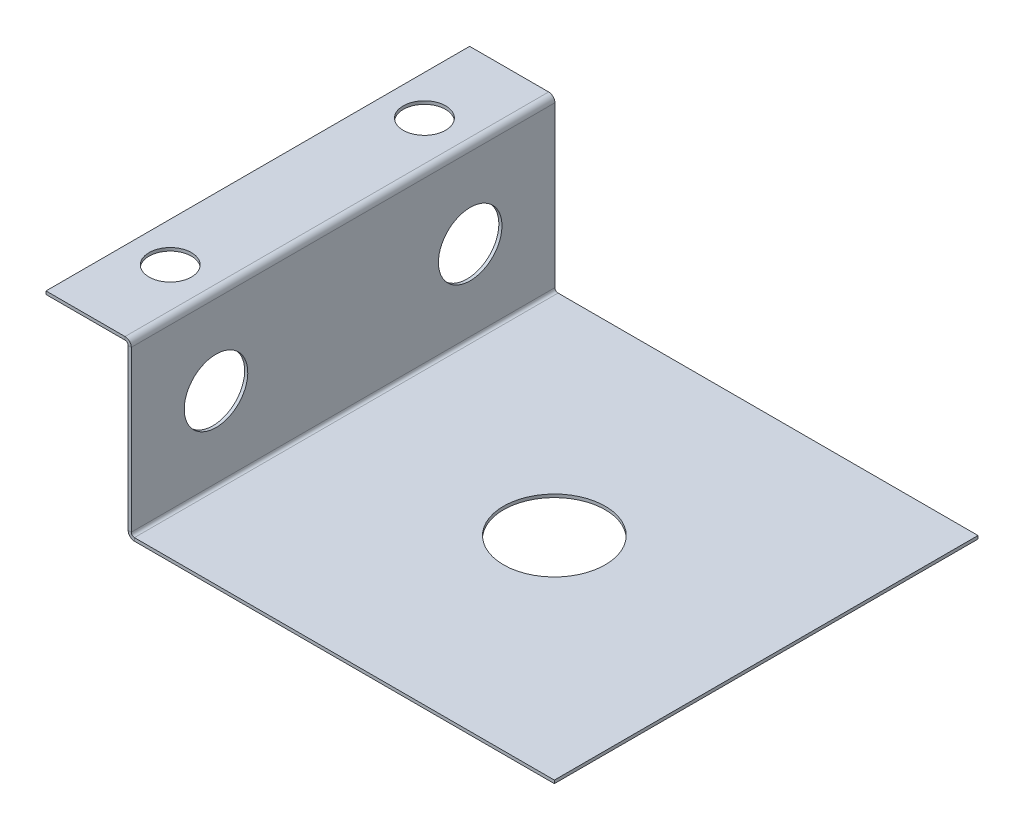
ISO-10303-21;
HEADER;
FILE_DESCRIPTION(('STEP AP214'),'2;1');
FILE_NAME('part.step','',(''),(''),'','','');
FILE_SCHEMA(('AUTOMOTIVE_DESIGN { 1 0 10303 214 1 1 1 1 }'));
ENDSEC;
DATA;
#1=APPLICATION_CONTEXT('core data for automotive mechanical design processes');
#2=APPLICATION_PROTOCOL_DEFINITION('international standard','automotive_design',2000,#1);
#3=PRODUCT_CONTEXT('',#1,'mechanical');
#4=PRODUCT('Part','Part','',(#3));
#5=PRODUCT_RELATED_PRODUCT_CATEGORY('part','',(#4));
#6=PRODUCT_DEFINITION_FORMATION('','',#4);
#7=PRODUCT_DEFINITION_CONTEXT('part definition',#1,'design');
#8=PRODUCT_DEFINITION('design','',#6,#7);
#9=PRODUCT_DEFINITION_SHAPE('','',#8);
#10=(LENGTH_UNIT() NAMED_UNIT(*) SI_UNIT(.MILLI.,.METRE.));
#11=(NAMED_UNIT(*) PLANE_ANGLE_UNIT() SI_UNIT($,.RADIAN.));
#12=(NAMED_UNIT(*) SI_UNIT($,.STERADIAN.) SOLID_ANGLE_UNIT());
#13=UNCERTAINTY_MEASURE_WITH_UNIT(LENGTH_MEASURE(1.E-05),#10,'distance_accuracy_value','');
#14=(GEOMETRIC_REPRESENTATION_CONTEXT(3) GLOBAL_UNCERTAINTY_ASSIGNED_CONTEXT((#13)) GLOBAL_UNIT_ASSIGNED_CONTEXT((#10,
#11,#12)) REPRESENTATION_CONTEXT('',''));
#15=CARTESIAN_POINT('',(0.,0.,0.));
#16=DIRECTION('',(0.,0.,1.));
#17=DIRECTION('',(1.,0.,0.));
#18=AXIS2_PLACEMENT_3D('',#15,#16,#17);
#19=CARTESIAN_POINT('',(-40.6054135692623,-40.1311864307378,0.));
#20=DIRECTION('',(1.,0.,0.));
#21=DIRECTION('',(0.,0.,1.));
#22=AXIS2_PLACEMENT_3D('',#19,#20,#21);
#23=PLANE('',#22);
#24=CARTESIAN_POINT('',(-40.6054135692621,19.6317,-30.));
#25=DIRECTION('',(1.,0.,0.));
#26=DIRECTION('',(0.,1.,0.));
#27=AXIS2_PLACEMENT_3D('',#24,#25,#26);
#28=CIRCLE('',#27,7.5);
#29=CARTESIAN_POINT('',(-40.6054135692621,27.1317,-30.));
#30=VERTEX_POINT('',#29);
#31=EDGE_CURVE('E299',#30,#30,#28,.T.);
#32=ORIENTED_EDGE('',*,*,#31,.T.);
#33=EDGE_LOOP('',(#32));
#34=FACE_BOUND('',#33,.T.);
#35=CARTESIAN_POINT('',(-40.6054135692621,19.6317,30.));
#36=DIRECTION('',(1.,0.,0.));
#37=DIRECTION('',(0.,1.,0.));
#38=AXIS2_PLACEMENT_3D('',#35,#36,#37);
#39=CIRCLE('',#38,7.5);
#40=CARTESIAN_POINT('',(-40.6054135692621,27.1317,30.));
#41=VERTEX_POINT('',#40);
#42=EDGE_CURVE('E287',#41,#41,#39,.T.);
#43=ORIENTED_EDGE('',*,*,#42,.T.);
#44=EDGE_LOOP('',(#43));
#45=FACE_BOUND('',#44,.T.);
#46=DIRECTION('',(0.,-1.,0.));
#47=VECTOR('',#46,1.);
#48=CARTESIAN_POINT('',(-40.6054135692625,-100.131186430738,50.));
#49=LINE('',#48,#47);
#50=CARTESIAN_POINT('',(-40.605413569262,38.5268,50.));
#51=VERTEX_POINT('',#50);
#52=CARTESIAN_POINT('',(-40.6054135692622,0.736600000000004,50.));
#53=VERTEX_POINT('',#52);
#54=EDGE_CURVE('E278',#51,#53,#49,.T.);
#55=ORIENTED_EDGE('',*,*,#54,.F.);
#56=DIRECTION('',(0.,0.,-1.));
#57=VECTOR('',#56,1.);
#58=CARTESIAN_POINT('',(-40.605413569262,38.5268,0.));
#59=LINE('',#58,#57);
#60=CARTESIAN_POINT('',(-40.605413569262,38.5268,-50.));
#61=VERTEX_POINT('',#60);
#62=EDGE_CURVE('E265',#51,#61,#59,.T.);
#63=ORIENTED_EDGE('',*,*,#62,.T.);
#64=DIRECTION('',(0.,1.,0.));
#65=VECTOR('',#64,1.);
#66=CARTESIAN_POINT('',(-40.6054135692625,-100.131186430738,-50.));
#67=LINE('',#66,#65);
#68=CARTESIAN_POINT('',(-40.6054135692622,0.736600000000008,-50.));
#69=VERTEX_POINT('',#68);
#70=EDGE_CURVE('E213',#69,#61,#67,.T.);
#71=ORIENTED_EDGE('',*,*,#70,.F.);
#72=DIRECTION('',(0.,0.,-1.));
#73=VECTOR('',#72,1.);
#74=CARTESIAN_POINT('',(-40.6054135692622,0.736600000000004,0.));
#75=LINE('',#74,#73);
#76=EDGE_CURVE('E252',#53,#69,#75,.T.);
#77=ORIENTED_EDGE('',*,*,#76,.F.);
#78=EDGE_LOOP('',(#55,#63,#71,#77));
#79=FACE_BOUND('',#78,.T.);
#80=ADVANCED_FACE('F46',(#34,#45,#79),#23,.F.);
#81=CARTESIAN_POINT('',(-40.6054135692625,-100.131186430738,-50.));
#82=DIRECTION('',(0.,0.,-1.));
#83=DIRECTION('',(0.,1.,0.));
#84=AXIS2_PLACEMENT_3D('',#81,#82,#83);
#85=PLANE('',#84);
#86=DIRECTION('',(-1.,0.,0.));
#87=VECTOR('',#86,1.);
#88=CARTESIAN_POINT('',(-40.605413569262,38.5268,-50.));
#89=LINE('',#88,#87);
#90=CARTESIAN_POINT('',(-39.868813569262,38.5268,-50.));
#91=VERTEX_POINT('',#90);
#92=EDGE_CURVE('E12',#91,#61,#89,.T.);
#93=ORIENTED_EDGE('',*,*,#92,.F.);
#94=DIRECTION('',(0.,1.,0.));
#95=VECTOR('',#94,1.);
#96=CARTESIAN_POINT('',(-39.8688135692625,-100.131186430738,-50.));
#97=LINE('',#96,#95);
#98=CARTESIAN_POINT('',(-39.8688135692622,0.736600000000004,-50.));
#99=VERTEX_POINT('',#98);
#100=EDGE_CURVE('E64',#99,#91,#97,.T.);
#101=ORIENTED_EDGE('',*,*,#100,.F.);
#102=DIRECTION('',(-1.,0.,0.));
#103=VECTOR('',#102,1.);
#104=CARTESIAN_POINT('',(-40.6054135692622,0.736600000000004,-50.));
#105=LINE('',#104,#103);
#106=EDGE_CURVE('E256',#99,#69,#105,.T.);
#107=ORIENTED_EDGE('',*,*,#106,.T.);
#108=ORIENTED_EDGE('',*,*,#70,.T.);
#109=EDGE_LOOP('',(#93,#101,#107,#108));
#110=FACE_BOUND('',#109,.T.);
#111=ADVANCED_FACE('F48',(#110),#85,.T.);
#112=CARTESIAN_POINT('',(-40.6054135692625,-100.131186430738,50.));
#113=DIRECTION('',(0.,0.,1.));
#114=DIRECTION('',(0.,-1.,0.));
#115=AXIS2_PLACEMENT_3D('',#112,#113,#114);
#116=PLANE('',#115);
#117=DIRECTION('',(1.,0.,0.));
#118=VECTOR('',#117,1.);
#119=CARTESIAN_POINT('',(-40.605413569262,38.5268,50.));
#120=LINE('',#119,#118);
#121=CARTESIAN_POINT('',(-39.868813569262,38.5268,50.));
#122=VERTEX_POINT('',#121);
#123=EDGE_CURVE('E269',#51,#122,#120,.T.);
#124=ORIENTED_EDGE('',*,*,#123,.F.);
#125=ORIENTED_EDGE('',*,*,#54,.T.);
#126=DIRECTION('',(1.,0.,0.));
#127=VECTOR('',#126,1.);
#128=CARTESIAN_POINT('',(-40.6054135692622,0.736600000000018,50.));
#129=LINE('',#128,#127);
#130=CARTESIAN_POINT('',(-39.8688135692622,0.736600000000018,50.));
#131=VERTEX_POINT('',#130);
#132=EDGE_CURVE('E262',#53,#131,#129,.T.);
#133=ORIENTED_EDGE('',*,*,#132,.T.);
#134=DIRECTION('',(0.,-1.,0.));
#135=VECTOR('',#134,1.);
#136=CARTESIAN_POINT('',(-39.8688135692625,-100.131186430738,50.));
#137=LINE('',#136,#135);
#138=EDGE_CURVE('E72',#122,#131,#137,.T.);
#139=ORIENTED_EDGE('',*,*,#138,.F.);
#140=EDGE_LOOP('',(#124,#125,#133,#139));
#141=FACE_BOUND('',#140,.T.);
#142=ADVANCED_FACE('F397',(#141),#116,.T.);
#143=CARTESIAN_POINT('',(-39.8688135692623,-40.1311864307378,0.));
#144=DIRECTION('',(1.,0.,0.));
#145=DIRECTION('',(0.,0.,1.));
#146=AXIS2_PLACEMENT_3D('',#143,#144,#145);
#147=PLANE('',#146);
#148=CARTESIAN_POINT('',(-39.8688135692621,19.6317,-30.));
#149=DIRECTION('',(1.,0.,0.));
#150=DIRECTION('',(0.,1.,0.));
#151=AXIS2_PLACEMENT_3D('',#148,#149,#150);
#152=CIRCLE('',#151,7.5);
#153=CARTESIAN_POINT('',(-39.8688135692621,27.1317,-30.));
#154=VERTEX_POINT('',#153);
#155=EDGE_CURVE('E50',#154,#154,#152,.T.);
#156=ORIENTED_EDGE('',*,*,#155,.F.);
#157=EDGE_LOOP('',(#156));
#158=FACE_BOUND('',#157,.T.);
#159=CARTESIAN_POINT('',(-39.8688135692621,19.6317,30.));
#160=DIRECTION('',(1.,0.,0.));
#161=DIRECTION('',(0.,1.,0.));
#162=AXIS2_PLACEMENT_3D('',#159,#160,#161);
#163=CIRCLE('',#162,7.5);
#164=CARTESIAN_POINT('',(-39.8688135692621,27.1317,30.));
#165=VERTEX_POINT('',#164);
#166=EDGE_CURVE('E284',#165,#165,#163,.T.);
#167=ORIENTED_EDGE('',*,*,#166,.F.);
#168=EDGE_LOOP('',(#167));
#169=FACE_BOUND('',#168,.T.);
#170=DIRECTION('',(0.,0.,-1.));
#171=VECTOR('',#170,1.);
#172=CARTESIAN_POINT('',(-39.868813569262,38.5268,0.));
#173=LINE('',#172,#171);
#174=EDGE_CURVE('E56',#122,#91,#173,.T.);
#175=ORIENTED_EDGE('',*,*,#174,.F.);
#176=ORIENTED_EDGE('',*,*,#138,.T.);
#177=DIRECTION('',(0.,0.,-1.));
#178=VECTOR('',#177,1.);
#179=CARTESIAN_POINT('',(-39.8688135692622,0.736600000000004,0.));
#180=LINE('',#179,#178);
#181=EDGE_CURVE('E259',#131,#99,#180,.T.);
#182=ORIENTED_EDGE('',*,*,#181,.T.);
#183=ORIENTED_EDGE('',*,*,#100,.T.);
#184=EDGE_LOOP('',(#175,#176,#182,#183));
#185=FACE_BOUND('',#184,.T.);
#186=ADVANCED_FACE('F424',(#158,#169,#185),#147,.T.);
#187=CARTESIAN_POINT('',(60.,-0.7366,50.));
#188=DIRECTION('',(1.,0.,0.));
#189=DIRECTION('',(0.,0.,-1.));
#190=AXIS2_PLACEMENT_3D('',#187,#188,#189);
#191=PLANE('',#190);
#192=DIRECTION('',(0.,0.,-1.));
#193=VECTOR('',#192,1.);
#194=CARTESIAN_POINT('',(60.,0.,50.));
#195=LINE('',#194,#193);
#196=CARTESIAN_POINT('',(60.,0.,50.));
#197=VERTEX_POINT('',#196);
#198=CARTESIAN_POINT('',(60.,0.,-50.));
#199=VERTEX_POINT('',#198);
#200=EDGE_CURVE('E220',#197,#199,#195,.T.);
#201=ORIENTED_EDGE('',*,*,#200,.F.);
#202=DIRECTION('',(0.,1.,0.));
#203=VECTOR('',#202,1.);
#204=CARTESIAN_POINT('',(60.,-0.7366,50.));
#205=LINE('',#204,#203);
#206=CARTESIAN_POINT('',(60.,-0.7366,50.));
#207=VERTEX_POINT('',#206);
#208=EDGE_CURVE('E209',#207,#197,#205,.T.);
#209=ORIENTED_EDGE('',*,*,#208,.F.);
#210=DIRECTION('',(0.,0.,-1.));
#211=VECTOR('',#210,1.);
#212=CARTESIAN_POINT('',(60.,-0.7366,50.));
#213=LINE('',#212,#211);
#214=CARTESIAN_POINT('',(60.,-0.7366,-50.));
#215=VERTEX_POINT('',#214);
#216=EDGE_CURVE('E237',#207,#215,#213,.T.);
#217=ORIENTED_EDGE('',*,*,#216,.T.);
#218=DIRECTION('',(0.,1.,0.));
#219=VECTOR('',#218,1.);
#220=CARTESIAN_POINT('',(60.,-0.7366,-50.));
#221=LINE('',#220,#219);
#222=EDGE_CURVE('E234',#215,#199,#221,.T.);
#223=ORIENTED_EDGE('',*,*,#222,.T.);
#224=EDGE_LOOP('',(#201,#209,#217,#223));
#225=FACE_BOUND('',#224,.T.);
#226=ADVANCED_FACE('F391',(#225),#191,.T.);
#227=CARTESIAN_POINT('',(0.,-0.7366,0.));
#228=DIRECTION('',(0.,1.,0.));
#229=DIRECTION('',(0.,0.,1.));
#230=AXIS2_PLACEMENT_3D('',#227,#228,#229);
#231=PLANE('',#230);
#232=CARTESIAN_POINT('',(9.99999999999999,-0.7366,0.));
#233=DIRECTION('',(0.,1.,0.));
#234=DIRECTION('',(0.,0.,1.));
#235=AXIS2_PLACEMENT_3D('',#232,#233,#234);
#236=CIRCLE('',#235,12.);
#237=CARTESIAN_POINT('',(9.99999999999999,-0.7366,12.));
#238=VERTEX_POINT('',#237);
#239=EDGE_CURVE('E173',#238,#238,#236,.T.);
#240=ORIENTED_EDGE('',*,*,#239,.T.);
#241=EDGE_LOOP('',(#240));
#242=FACE_BOUND('',#241,.T.);
#243=DIRECTION('',(1.,0.,0.));
#244=VECTOR('',#243,1.);
#245=CARTESIAN_POINT('',(60.,-0.7366,50.));
#246=LINE('',#245,#244);
#247=CARTESIAN_POINT('',(-39.1322135692621,-0.7366,50.));
#248=VERTEX_POINT('',#247);
#249=EDGE_CURVE('E214',#248,#207,#246,.T.);
#250=ORIENTED_EDGE('',*,*,#249,.F.);
#251=DIRECTION('',(0.,0.,-1.));
#252=VECTOR('',#251,1.);
#253=CARTESIAN_POINT('',(-39.1322135692621,-0.7366,0.));
#254=LINE('',#253,#252);
#255=CARTESIAN_POINT('',(-39.1322135692622,-0.7366,-50.));
#256=VERTEX_POINT('',#255);
#257=EDGE_CURVE('E230',#248,#256,#254,.T.);
#258=ORIENTED_EDGE('',*,*,#257,.T.);
#259=DIRECTION('',(-1.,0.,0.));
#260=VECTOR('',#259,1.);
#261=CARTESIAN_POINT('',(60.,-0.7366,-50.));
#262=LINE('',#261,#260);
#263=EDGE_CURVE('E227',#215,#256,#262,.T.);
#264=ORIENTED_EDGE('',*,*,#263,.F.);
#265=ORIENTED_EDGE('',*,*,#216,.F.);
#266=EDGE_LOOP('',(#250,#258,#264,#265));
#267=FACE_BOUND('',#266,.T.);
#268=ADVANCED_FACE('F430',(#242,#267),#231,.F.);
#269=CARTESIAN_POINT('',(60.,-0.7366,-50.));
#270=DIRECTION('',(0.,0.,-1.));
#271=DIRECTION('',(-1.,0.,0.));
#272=AXIS2_PLACEMENT_3D('',#269,#270,#271);
#273=PLANE('',#272);
#274=DIRECTION('',(0.,-1.,0.));
#275=VECTOR('',#274,1.);
#276=CARTESIAN_POINT('',(-39.1322135692622,-0.7366,-50.));
#277=LINE('',#276,#275);
#278=CARTESIAN_POINT('',(-39.1322135692622,0.,-50.));
#279=VERTEX_POINT('',#278);
#280=EDGE_CURVE('E241',#279,#256,#277,.T.);
#281=ORIENTED_EDGE('',*,*,#280,.F.);
#282=DIRECTION('',(-1.,0.,0.));
#283=VECTOR('',#282,1.);
#284=CARTESIAN_POINT('',(60.,0.,-50.));
#285=LINE('',#284,#283);
#286=EDGE_CURVE('E217',#199,#279,#285,.T.);
#287=ORIENTED_EDGE('',*,*,#286,.F.);
#288=ORIENTED_EDGE('',*,*,#222,.F.);
#289=ORIENTED_EDGE('',*,*,#263,.T.);
#290=EDGE_LOOP('',(#281,#287,#288,#289));
#291=FACE_BOUND('',#290,.T.);
#292=ADVANCED_FACE('F393',(#291),#273,.T.);
#293=CARTESIAN_POINT('',(0.,0.,0.));
#294=DIRECTION('',(0.,1.,0.));
#295=DIRECTION('',(0.,0.,1.));
#296=AXIS2_PLACEMENT_3D('',#293,#294,#295);
#297=PLANE('',#296);
#298=CARTESIAN_POINT('',(9.99999999999999,0.,0.));
#299=DIRECTION('',(0.,1.,0.));
#300=DIRECTION('',(0.,0.,1.));
#301=AXIS2_PLACEMENT_3D('',#298,#299,#300);
#302=CIRCLE('',#301,12.);
#303=CARTESIAN_POINT('',(9.99999999999999,0.,12.));
#304=VERTEX_POINT('',#303);
#305=EDGE_CURVE('E320',#304,#304,#302,.T.);
#306=ORIENTED_EDGE('',*,*,#305,.F.);
#307=EDGE_LOOP('',(#306));
#308=FACE_BOUND('',#307,.T.);
#309=DIRECTION('',(0.,0.,-1.));
#310=VECTOR('',#309,1.);
#311=CARTESIAN_POINT('',(-39.1322135692621,0.,0.));
#312=LINE('',#311,#310);
#313=CARTESIAN_POINT('',(-39.1322135692621,0.,50.));
#314=VERTEX_POINT('',#313);
#315=EDGE_CURVE('E245',#314,#279,#312,.T.);
#316=ORIENTED_EDGE('',*,*,#315,.F.);
#317=DIRECTION('',(1.,0.,0.));
#318=VECTOR('',#317,1.);
#319=CARTESIAN_POINT('',(60.,0.,50.));
#320=LINE('',#319,#318);
#321=EDGE_CURVE('E224',#314,#197,#320,.T.);
#322=ORIENTED_EDGE('',*,*,#321,.T.);
#323=ORIENTED_EDGE('',*,*,#200,.T.);
#324=ORIENTED_EDGE('',*,*,#286,.T.);
#325=EDGE_LOOP('',(#316,#322,#323,#324));
#326=FACE_BOUND('',#325,.T.);
#327=ADVANCED_FACE('F376',(#308,#326),#297,.T.);
#328=CARTESIAN_POINT('',(60.,-0.7366,50.));
#329=DIRECTION('',(0.,0.,1.));
#330=DIRECTION('',(1.,0.,0.));
#331=AXIS2_PLACEMENT_3D('',#328,#329,#330);
#332=PLANE('',#331);
#333=DIRECTION('',(0.,1.,0.));
#334=VECTOR('',#333,1.);
#335=CARTESIAN_POINT('',(-39.1322135692622,-0.7366,50.));
#336=LINE('',#335,#334);
#337=EDGE_CURVE('E202',#248,#314,#336,.T.);
#338=ORIENTED_EDGE('',*,*,#337,.F.);
#339=ORIENTED_EDGE('',*,*,#249,.T.);
#340=ORIENTED_EDGE('',*,*,#208,.T.);
#341=ORIENTED_EDGE('',*,*,#321,.F.);
#342=EDGE_LOOP('',(#338,#339,#340,#341));
#343=FACE_BOUND('',#342,.T.);
#344=ADVANCED_FACE('F386',(#343),#332,.T.);
#345=CARTESIAN_POINT('',(-39.1322135692621,0.7366,50.));
#346=DIRECTION('',(0.,0.,1.));
#347=DIRECTION('',(1.,0.,0.));
#348=AXIS2_PLACEMENT_3D('',#345,#346,#347);
#349=PLANE('',#348);
#350=ORIENTED_EDGE('',*,*,#337,.T.);
#351=CARTESIAN_POINT('',(-39.1322135692621,0.7366,50.));
#352=DIRECTION('',(0.,0.,-1.));
#353=DIRECTION('',(-1.,0.,0.));
#354=AXIS2_PLACEMENT_3D('',#351,#352,#353);
#355=CIRCLE('',#354,0.7366);
#356=EDGE_CURVE('E186',#314,#131,#355,.T.);
#357=ORIENTED_EDGE('',*,*,#356,.T.);
#358=ORIENTED_EDGE('',*,*,#132,.F.);
#359=CARTESIAN_POINT('',(-39.1322135692621,0.7366,50.));
#360=DIRECTION('',(0.,0.,-1.));
#361=DIRECTION('',(1.,0.,0.));
#362=AXIS2_PLACEMENT_3D('',#359,#360,#361);
#363=CIRCLE('',#362,1.4732);
#364=EDGE_CURVE('E193',#248,#53,#363,.T.);
#365=ORIENTED_EDGE('',*,*,#364,.F.);
#366=EDGE_LOOP('',(#350,#357,#358,#365));
#367=FACE_BOUND('',#366,.T.);
#368=ADVANCED_FACE('F382',(#367),#349,.T.);
#369=CARTESIAN_POINT('',(-39.1322135692622,0.7366,-50.));
#370=DIRECTION('',(0.,0.,-1.));
#371=DIRECTION('',(-1.,0.,0.));
#372=AXIS2_PLACEMENT_3D('',#369,#370,#371);
#373=PLANE('',#372);
#374=ORIENTED_EDGE('',*,*,#106,.F.);
#375=CARTESIAN_POINT('',(-39.1322135692622,0.7366,-50.));
#376=DIRECTION('',(0.,0.,-1.));
#377=DIRECTION('',(-1.,0.,0.));
#378=AXIS2_PLACEMENT_3D('',#375,#376,#377);
#379=CIRCLE('',#378,0.7366);
#380=EDGE_CURVE('E198',#99,#279,#379,.F.);
#381=ORIENTED_EDGE('',*,*,#380,.T.);
#382=ORIENTED_EDGE('',*,*,#280,.T.);
#383=CARTESIAN_POINT('',(-39.1322135692622,0.7366,-50.));
#384=DIRECTION('',(0.,0.,1.));
#385=DIRECTION('',(-1.,0.,0.));
#386=AXIS2_PLACEMENT_3D('',#383,#384,#385);
#387=CIRCLE('',#386,1.4732);
#388=EDGE_CURVE('E197',#69,#256,#387,.T.);
#389=ORIENTED_EDGE('',*,*,#388,.F.);
#390=EDGE_LOOP('',(#374,#381,#382,#389));
#391=FACE_BOUND('',#390,.T.);
#392=ADVANCED_FACE('F369',(#391),#373,.T.);
#393=CARTESIAN_POINT('',(-39.1322135692621,0.7366,100.017772384299));
#394=DIRECTION('',(0.,0.,-1.));
#395=DIRECTION('',(-1.,0.,0.));
#396=AXIS2_PLACEMENT_3D('',#393,#394,#395);
#397=CYLINDRICAL_SURFACE('',#396,1.4732);
#398=ORIENTED_EDGE('',*,*,#388,.T.);
#399=ORIENTED_EDGE('',*,*,#257,.F.);
#400=ORIENTED_EDGE('',*,*,#364,.T.);
#401=ORIENTED_EDGE('',*,*,#76,.T.);
#402=EDGE_LOOP('',(#398,#399,#400,#401));
#403=FACE_BOUND('',#402,.T.);
#404=ADVANCED_FACE('F396',(#403),#397,.T.);
#405=CARTESIAN_POINT('',(-39.1322135692621,0.7366,100.017772384299));
#406=DIRECTION('',(0.,0.,-1.));
#407=DIRECTION('',(-1.,0.,0.));
#408=AXIS2_PLACEMENT_3D('',#405,#406,#407);
#409=CYLINDRICAL_SURFACE('',#408,0.7366);
#410=ORIENTED_EDGE('',*,*,#380,.F.);
#411=ORIENTED_EDGE('',*,*,#181,.F.);
#412=ORIENTED_EDGE('',*,*,#356,.F.);
#413=ORIENTED_EDGE('',*,*,#315,.T.);
#414=EDGE_LOOP('',(#410,#411,#412,#413));
#415=FACE_BOUND('',#414,.T.);
#416=ADVANCED_FACE('F372',(#415),#409,.F.);
#417=CARTESIAN_POINT('',(-41.342013569262,38.5268,50.));
#418=DIRECTION('',(0.,0.,-1.));
#419=DIRECTION('',(-1.,0.,0.));
#420=AXIS2_PLACEMENT_3D('',#417,#418,#419);
#421=PLANE('',#420);
#422=ORIENTED_EDGE('',*,*,#123,.T.);
#423=CARTESIAN_POINT('',(-41.342013569262,38.5268,50.));
#424=DIRECTION('',(0.,0.,-1.));
#425=DIRECTION('',(-1.,0.,0.));
#426=AXIS2_PLACEMENT_3D('',#423,#424,#425);
#427=CIRCLE('',#426,1.4732);
#428=CARTESIAN_POINT('',(-41.342013569262,40.,50.));
#429=VERTEX_POINT('',#428);
#430=EDGE_CURVE('E159',#122,#429,#427,.F.);
#431=ORIENTED_EDGE('',*,*,#430,.T.);
#432=DIRECTION('',(0.,1.,0.));
#433=VECTOR('',#432,1.);
#434=CARTESIAN_POINT('',(-41.342013569262,39.2634,50.));
#435=LINE('',#434,#433);
#436=CARTESIAN_POINT('',(-41.342013569262,39.2634,50.));
#437=VERTEX_POINT('',#436);
#438=EDGE_CURVE('E341',#437,#429,#435,.T.);
#439=ORIENTED_EDGE('',*,*,#438,.F.);
#440=CARTESIAN_POINT('',(-41.342013569262,38.5268,50.));
#441=DIRECTION('',(0.,0.,1.));
#442=DIRECTION('',(-1.,0.,0.));
#443=AXIS2_PLACEMENT_3D('',#440,#441,#442);
#444=CIRCLE('',#443,0.736599999999993);
#445=EDGE_CURVE('E177',#51,#437,#444,.T.);
#446=ORIENTED_EDGE('',*,*,#445,.F.);
#447=EDGE_LOOP('',(#422,#431,#439,#446));
#448=FACE_BOUND('',#447,.T.);
#449=ADVANCED_FACE('F352',(#448),#421,.F.);
#450=CARTESIAN_POINT('',(-41.342013569262,38.5268,-50.));
#451=DIRECTION('',(0.,0.,1.));
#452=DIRECTION('',(1.,0.,0.));
#453=AXIS2_PLACEMENT_3D('',#450,#451,#452);
#454=PLANE('',#453);
#455=DIRECTION('',(0.,-1.,0.));
#456=VECTOR('',#455,1.);
#457=CARTESIAN_POINT('',(-41.342013569262,39.2634,-50.));
#458=LINE('',#457,#456);
#459=CARTESIAN_POINT('',(-41.342013569262,40.,-50.));
#460=VERTEX_POINT('',#459);
#461=CARTESIAN_POINT('',(-41.342013569262,39.2634,-50.));
#462=VERTEX_POINT('',#461);
#463=EDGE_CURVE('E145',#460,#462,#458,.T.);
#464=ORIENTED_EDGE('',*,*,#463,.F.);
#465=CARTESIAN_POINT('',(-41.342013569262,38.5268,-50.));
#466=DIRECTION('',(0.,0.,-1.));
#467=DIRECTION('',(-1.,0.,0.));
#468=AXIS2_PLACEMENT_3D('',#465,#466,#467);
#469=CIRCLE('',#468,1.4732);
#470=EDGE_CURVE('E182',#460,#91,#469,.T.);
#471=ORIENTED_EDGE('',*,*,#470,.T.);
#472=ORIENTED_EDGE('',*,*,#92,.T.);
#473=CARTESIAN_POINT('',(-41.342013569262,38.5268,-50.));
#474=DIRECTION('',(0.,0.,-1.));
#475=DIRECTION('',(1.,0.,0.));
#476=AXIS2_PLACEMENT_3D('',#473,#474,#475);
#477=CIRCLE('',#476,0.736599999999993);
#478=EDGE_CURVE('E181',#462,#61,#477,.T.);
#479=ORIENTED_EDGE('',*,*,#478,.F.);
#480=EDGE_LOOP('',(#464,#471,#472,#479));
#481=FACE_BOUND('',#480,.T.);
#482=ADVANCED_FACE('F362',(#481),#454,.F.);
#483=CARTESIAN_POINT('',(-41.342013569262,38.5268,100.017772384299));
#484=DIRECTION('',(0.,0.,-1.));
#485=DIRECTION('',(-1.,0.,0.));
#486=AXIS2_PLACEMENT_3D('',#483,#484,#485);
#487=CYLINDRICAL_SURFACE('',#486,0.7366);
#488=ORIENTED_EDGE('',*,*,#478,.T.);
#489=ORIENTED_EDGE('',*,*,#62,.F.);
#490=ORIENTED_EDGE('',*,*,#445,.T.);
#491=DIRECTION('',(0.,0.,-1.));
#492=VECTOR('',#491,1.);
#493=CARTESIAN_POINT('',(-41.342013569262,39.2634,0.));
#494=LINE('',#493,#492);
#495=EDGE_CURVE('E167',#437,#462,#494,.T.);
#496=ORIENTED_EDGE('',*,*,#495,.T.);
#497=EDGE_LOOP('',(#488,#489,#490,#496));
#498=FACE_BOUND('',#497,.T.);
#499=ADVANCED_FACE('F356',(#498),#487,.F.);
#500=CARTESIAN_POINT('',(-41.342013569262,38.5268,100.017772384299));
#501=DIRECTION('',(0.,0.,-1.));
#502=DIRECTION('',(-1.,0.,0.));
#503=AXIS2_PLACEMENT_3D('',#500,#501,#502);
#504=CYLINDRICAL_SURFACE('',#503,1.4732);
#505=ORIENTED_EDGE('',*,*,#470,.F.);
#506=DIRECTION('',(0.,0.,-1.));
#507=VECTOR('',#506,1.);
#508=CARTESIAN_POINT('',(-41.342013569262,40.,0.));
#509=LINE('',#508,#507);
#510=EDGE_CURVE('E334',#429,#460,#509,.T.);
#511=ORIENTED_EDGE('',*,*,#510,.F.);
#512=ORIENTED_EDGE('',*,*,#430,.F.);
#513=ORIENTED_EDGE('',*,*,#174,.T.);
#514=EDGE_LOOP('',(#505,#511,#512,#513));
#515=FACE_BOUND('',#514,.T.);
#516=ADVANCED_FACE('F399',(#515),#504,.T.);
#517=CARTESIAN_POINT('',(-59.9999999999998,39.2634,50.));
#518=DIRECTION('',(-1.,0.,0.));
#519=DIRECTION('',(0.,0.,1.));
#520=AXIS2_PLACEMENT_3D('',#517,#518,#519);
#521=PLANE('',#520);
#522=DIRECTION('',(0.,0.,1.));
#523=VECTOR('',#522,1.);
#524=CARTESIAN_POINT('',(-59.9999999999998,40.,50.));
#525=LINE('',#524,#523);
#526=CARTESIAN_POINT('',(-59.9999999999999,40.,-50.));
#527=VERTEX_POINT('',#526);
#528=CARTESIAN_POINT('',(-59.9999999999998,40.,50.));
#529=VERTEX_POINT('',#528);
#530=EDGE_CURVE('E157',#527,#529,#525,.T.);
#531=ORIENTED_EDGE('',*,*,#530,.F.);
#532=DIRECTION('',(0.,1.,0.));
#533=VECTOR('',#532,1.);
#534=CARTESIAN_POINT('',(-59.9999999999999,39.2634,-50.));
#535=LINE('',#534,#533);
#536=CARTESIAN_POINT('',(-59.9999999999999,39.2634,-50.));
#537=VERTEX_POINT('',#536);
#538=EDGE_CURVE('E142',#537,#527,#535,.T.);
#539=ORIENTED_EDGE('',*,*,#538,.F.);
#540=DIRECTION('',(0.,0.,1.));
#541=VECTOR('',#540,1.);
#542=CARTESIAN_POINT('',(-59.9999999999998,39.2634,50.));
#543=LINE('',#542,#541);
#544=CARTESIAN_POINT('',(-59.9999999999998,39.2634,50.));
#545=VERTEX_POINT('',#544);
#546=EDGE_CURVE('E155',#537,#545,#543,.T.);
#547=ORIENTED_EDGE('',*,*,#546,.T.);
#548=DIRECTION('',(0.,1.,0.));
#549=VECTOR('',#548,1.);
#550=CARTESIAN_POINT('',(-59.9999999999998,39.2634,50.));
#551=LINE('',#550,#549);
#552=EDGE_CURVE('E166',#545,#529,#551,.T.);
#553=ORIENTED_EDGE('',*,*,#552,.T.);
#554=EDGE_LOOP('',(#531,#539,#547,#553));
#555=FACE_BOUND('',#554,.T.);
#556=ADVANCED_FACE('F153',(#555),#521,.T.);
#557=CARTESIAN_POINT('',(39.0515457229515,39.2634,0.));
#558=DIRECTION('',(0.,1.,0.));
#559=DIRECTION('',(0.,0.,1.));
#560=AXIS2_PLACEMENT_3D('',#557,#558,#559);
#561=PLANE('',#560);
#562=CARTESIAN_POINT('',(-50.6710067846309,39.2634,-30.));
#563=DIRECTION('',(0.,1.,0.));
#564=DIRECTION('',(0.,0.,1.));
#565=AXIS2_PLACEMENT_3D('',#562,#563,#564);
#566=CIRCLE('',#565,5.);
#567=CARTESIAN_POINT('',(-50.6710067846309,39.2634,-25.));
#568=VERTEX_POINT('',#567);
#569=EDGE_CURVE('E316',#568,#568,#566,.T.);
#570=ORIENTED_EDGE('',*,*,#569,.T.);
#571=EDGE_LOOP('',(#570));
#572=FACE_BOUND('',#571,.T.);
#573=CARTESIAN_POINT('',(-50.6710067846309,39.2634,30.));
#574=DIRECTION('',(0.,1.,0.));
#575=DIRECTION('',(0.,0.,1.));
#576=AXIS2_PLACEMENT_3D('',#573,#574,#575);
#577=CIRCLE('',#576,4.99999999999999);
#578=CARTESIAN_POINT('',(-50.6710067846309,39.2634,35.));
#579=VERTEX_POINT('',#578);
#580=EDGE_CURVE('E309',#579,#579,#577,.T.);
#581=ORIENTED_EDGE('',*,*,#580,.T.);
#582=EDGE_LOOP('',(#581));
#583=FACE_BOUND('',#582,.T.);
#584=ORIENTED_EDGE('',*,*,#495,.F.);
#585=DIRECTION('',(1.,0.,0.));
#586=VECTOR('',#585,1.);
#587=CARTESIAN_POINT('',(99.0515457229515,39.2634,50.));
#588=LINE('',#587,#586);
#589=EDGE_CURVE('E163',#545,#437,#588,.T.);
#590=ORIENTED_EDGE('',*,*,#589,.F.);
#591=ORIENTED_EDGE('',*,*,#546,.F.);
#592=DIRECTION('',(-1.,0.,0.));
#593=VECTOR('',#592,1.);
#594=CARTESIAN_POINT('',(99.0515457229515,39.2634,-50.));
#595=LINE('',#594,#593);
#596=EDGE_CURVE('E139',#462,#537,#595,.T.);
#597=ORIENTED_EDGE('',*,*,#596,.F.);
#598=EDGE_LOOP('',(#584,#590,#591,#597));
#599=FACE_BOUND('',#598,.T.);
#600=ADVANCED_FACE('F161',(#572,#583,#599),#561,.F.);
#601=CARTESIAN_POINT('',(99.0515457229515,39.2634,50.));
#602=DIRECTION('',(0.,0.,1.));
#603=DIRECTION('',(1.,0.,0.));
#604=AXIS2_PLACEMENT_3D('',#601,#602,#603);
#605=PLANE('',#604);
#606=ORIENTED_EDGE('',*,*,#589,.T.);
#607=ORIENTED_EDGE('',*,*,#438,.T.);
#608=DIRECTION('',(1.,0.,0.));
#609=VECTOR('',#608,1.);
#610=CARTESIAN_POINT('',(99.0515457229515,40.,50.));
#611=LINE('',#610,#609);
#612=EDGE_CURVE('E338',#529,#429,#611,.T.);
#613=ORIENTED_EDGE('',*,*,#612,.F.);
#614=ORIENTED_EDGE('',*,*,#552,.F.);
#615=EDGE_LOOP('',(#606,#607,#613,#614));
#616=FACE_BOUND('',#615,.T.);
#617=ADVANCED_FACE('F348',(#616),#605,.T.);
#618=CARTESIAN_POINT('',(39.0515457229515,40.,0.));
#619=DIRECTION('',(0.,1.,0.));
#620=DIRECTION('',(0.,0.,1.));
#621=AXIS2_PLACEMENT_3D('',#618,#619,#620);
#622=PLANE('',#621);
#623=CARTESIAN_POINT('',(-50.6710067846309,40.,-30.));
#624=DIRECTION('',(0.,1.,0.));
#625=DIRECTION('',(0.,0.,1.));
#626=AXIS2_PLACEMENT_3D('',#623,#624,#625);
#627=CIRCLE('',#626,5.);
#628=CARTESIAN_POINT('',(-50.6710067846309,40.,-25.));
#629=VERTEX_POINT('',#628);
#630=EDGE_CURVE('E305',#629,#629,#627,.T.);
#631=ORIENTED_EDGE('',*,*,#630,.F.);
#632=EDGE_LOOP('',(#631));
#633=FACE_BOUND('',#632,.T.);
#634=CARTESIAN_POINT('',(-50.6710067846309,40.,30.));
#635=DIRECTION('',(0.,1.,0.));
#636=DIRECTION('',(0.,0.,-1.));
#637=AXIS2_PLACEMENT_3D('',#634,#635,#636);
#638=CIRCLE('',#637,4.99999999999999);
#639=CARTESIAN_POINT('',(-50.6710067846309,40.,25.));
#640=VERTEX_POINT('',#639);
#641=EDGE_CURVE('E304',#640,#640,#638,.T.);
#642=ORIENTED_EDGE('',*,*,#641,.F.);
#643=EDGE_LOOP('',(#642));
#644=FACE_BOUND('',#643,.T.);
#645=ORIENTED_EDGE('',*,*,#612,.T.);
#646=ORIENTED_EDGE('',*,*,#510,.T.);
#647=DIRECTION('',(-1.,0.,0.));
#648=VECTOR('',#647,1.);
#649=CARTESIAN_POINT('',(99.0515457229515,40.,-50.));
#650=LINE('',#649,#648);
#651=EDGE_CURVE('E331',#460,#527,#650,.T.);
#652=ORIENTED_EDGE('',*,*,#651,.T.);
#653=ORIENTED_EDGE('',*,*,#530,.T.);
#654=EDGE_LOOP('',(#645,#646,#652,#653));
#655=FACE_BOUND('',#654,.T.);
#656=ADVANCED_FACE('F401',(#633,#644,#655),#622,.T.);
#657=CARTESIAN_POINT('',(99.0515457229515,39.2634,-50.));
#658=DIRECTION('',(0.,0.,-1.));
#659=DIRECTION('',(-1.,0.,0.));
#660=AXIS2_PLACEMENT_3D('',#657,#658,#659);
#661=PLANE('',#660);
#662=ORIENTED_EDGE('',*,*,#651,.F.);
#663=ORIENTED_EDGE('',*,*,#463,.T.);
#664=ORIENTED_EDGE('',*,*,#596,.T.);
#665=ORIENTED_EDGE('',*,*,#538,.T.);
#666=EDGE_LOOP('',(#662,#663,#664,#665));
#667=FACE_BOUND('',#666,.T.);
#668=ADVANCED_FACE('F141',(#667),#661,.T.);
#669=CARTESIAN_POINT('',(9.99999999999999,-2.,0.));
#670=DIRECTION('',(0.,1.,0.));
#671=DIRECTION('',(0.,0.,1.));
#672=AXIS2_PLACEMENT_3D('',#669,#670,#671);
#673=CYLINDRICAL_SURFACE('',#672,12.);
#674=ORIENTED_EDGE('',*,*,#305,.T.);
#675=EDGE_LOOP('',(#674));
#676=FACE_BOUND('',#675,.T.);
#677=ORIENTED_EDGE('',*,*,#239,.F.);
#678=EDGE_LOOP('',(#677));
#679=FACE_BOUND('',#678,.T.);
#680=ADVANCED_FACE('F409',(#676,#679),#673,.F.);
#681=CARTESIAN_POINT('',(-50.6710067846309,38.2,30.));
#682=DIRECTION('',(0.,1.,0.));
#683=DIRECTION('',(0.,0.,1.));
#684=AXIS2_PLACEMENT_3D('',#681,#682,#683);
#685=CYLINDRICAL_SURFACE('',#684,4.99999999999999);
#686=ORIENTED_EDGE('',*,*,#641,.T.);
#687=EDGE_LOOP('',(#686));
#688=FACE_BOUND('',#687,.T.);
#689=ORIENTED_EDGE('',*,*,#580,.F.);
#690=EDGE_LOOP('',(#689));
#691=FACE_BOUND('',#690,.T.);
#692=ADVANCED_FACE('F449',(#688,#691),#685,.F.);
#693=CARTESIAN_POINT('',(-50.6710067846309,38.2,-30.));
#694=DIRECTION('',(0.,1.,0.));
#695=DIRECTION('',(0.,0.,1.));
#696=AXIS2_PLACEMENT_3D('',#693,#694,#695);
#697=CYLINDRICAL_SURFACE('',#696,5.);
#698=ORIENTED_EDGE('',*,*,#630,.T.);
#699=EDGE_LOOP('',(#698));
#700=FACE_BOUND('',#699,.T.);
#701=ORIENTED_EDGE('',*,*,#569,.F.);
#702=EDGE_LOOP('',(#701));
#703=FACE_BOUND('',#702,.T.);
#704=ADVANCED_FACE('F444',(#700,#703),#697,.F.);
#705=CARTESIAN_POINT('',(-41.8,19.6317,30.));
#706=DIRECTION('',(1.,0.,0.));
#707=DIRECTION('',(0.,0.,-1.));
#708=AXIS2_PLACEMENT_3D('',#705,#706,#707);
#709=CYLINDRICAL_SURFACE('',#708,7.5);
#710=ORIENTED_EDGE('',*,*,#166,.T.);
#711=EDGE_LOOP('',(#710));
#712=FACE_BOUND('',#711,.T.);
#713=ORIENTED_EDGE('',*,*,#42,.F.);
#714=EDGE_LOOP('',(#713));
#715=FACE_BOUND('',#714,.T.);
#716=ADVANCED_FACE('F438',(#712,#715),#709,.F.);
#717=CARTESIAN_POINT('',(-41.8,19.6317,-30.));
#718=DIRECTION('',(1.,0.,0.));
#719=DIRECTION('',(0.,0.,-1.));
#720=AXIS2_PLACEMENT_3D('',#717,#718,#719);
#721=CYLINDRICAL_SURFACE('',#720,7.5);
#722=ORIENTED_EDGE('',*,*,#155,.T.);
#723=EDGE_LOOP('',(#722));
#724=FACE_BOUND('',#723,.T.);
#725=ORIENTED_EDGE('',*,*,#31,.F.);
#726=EDGE_LOOP('',(#725));
#727=FACE_BOUND('',#726,.T.);
#728=ADVANCED_FACE('F435',(#724,#727),#721,.F.);
#729=CLOSED_SHELL('',(#80,#111,#142,#186,#226,#268,#292,#327,#344,#368,#392,#404,#416,#449,#482,
#499,#516,#556,#600,#617,#656,#668,#680,#692,#704,#716,#728));
#730=MANIFOLD_SOLID_BREP('B2',#729);
#731=ADVANCED_BREP_SHAPE_REPRESENTATION('',(#18,#730),#14);
#732=SHAPE_DEFINITION_REPRESENTATION(#9,#731);
ENDSEC;
END-ISO-10303-21;
